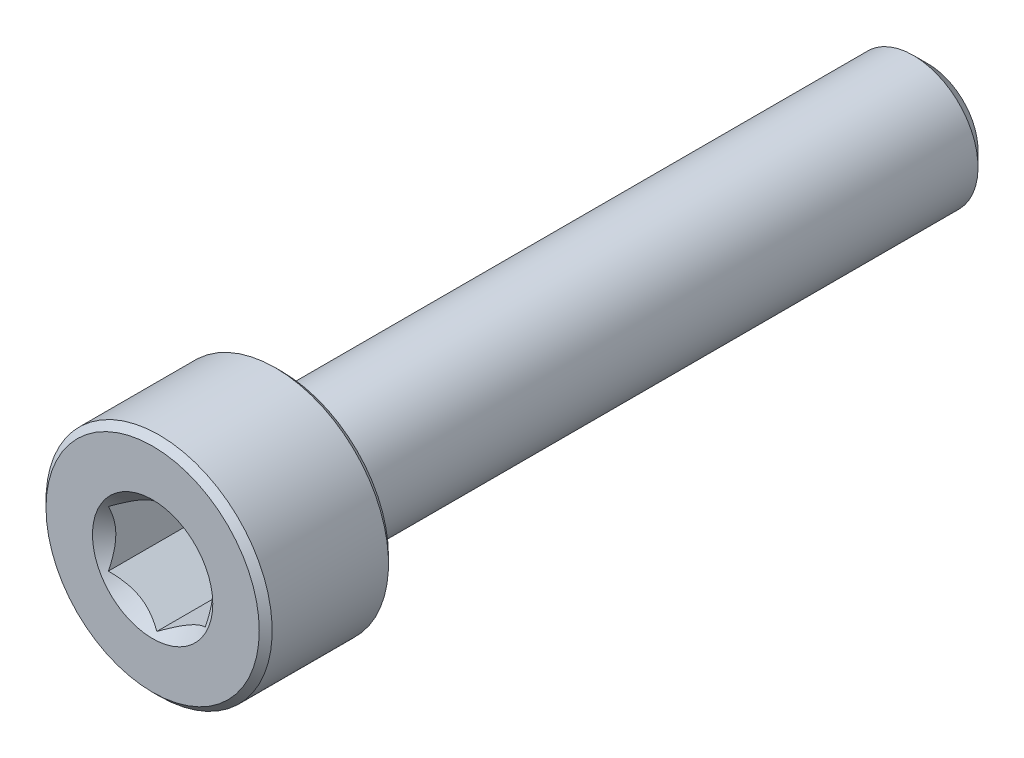
ISO-10303-21;
HEADER;
FILE_DESCRIPTION(('STEP AP214'),'2;1');
FILE_NAME('part.step','',(''),(''),'','','');
FILE_SCHEMA(('AUTOMOTIVE_DESIGN { 1 0 10303 214 1 1 1 1 }'));
ENDSEC;
DATA;
#1=APPLICATION_CONTEXT('core data for automotive mechanical design processes');
#2=APPLICATION_PROTOCOL_DEFINITION('international standard','automotive_design',2000,#1);
#3=PRODUCT_CONTEXT('',#1,'mechanical');
#4=PRODUCT('Part','Part','',(#3));
#5=PRODUCT_RELATED_PRODUCT_CATEGORY('part','',(#4));
#6=PRODUCT_DEFINITION_FORMATION('','',#4);
#7=PRODUCT_DEFINITION_CONTEXT('part definition',#1,'design');
#8=PRODUCT_DEFINITION('design','',#6,#7);
#9=PRODUCT_DEFINITION_SHAPE('','',#8);
#10=(LENGTH_UNIT() NAMED_UNIT(*) SI_UNIT(.MILLI.,.METRE.));
#11=(NAMED_UNIT(*) PLANE_ANGLE_UNIT() SI_UNIT($,.RADIAN.));
#12=(NAMED_UNIT(*) SI_UNIT($,.STERADIAN.) SOLID_ANGLE_UNIT());
#13=UNCERTAINTY_MEASURE_WITH_UNIT(LENGTH_MEASURE(1.E-05),#10,'distance_accuracy_value','');
#14=(GEOMETRIC_REPRESENTATION_CONTEXT(3) GLOBAL_UNCERTAINTY_ASSIGNED_CONTEXT((#13)) GLOBAL_UNIT_ASSIGNED_CONTEXT((#10,
#11,#12)) REPRESENTATION_CONTEXT('',''));
#15=CARTESIAN_POINT('',(0.,0.,0.));
#16=DIRECTION('',(0.,0.,1.));
#17=DIRECTION('',(1.,0.,0.));
#18=AXIS2_PLACEMENT_3D('',#15,#16,#17);
#19=CARTESIAN_POINT('',(0.,1.54533666301317,-12.));
#20=DIRECTION('',(0.,0.,-1.));
#21=DIRECTION('',(0.,1.,0.));
#22=AXIS2_PLACEMENT_3D('',#19,#20,#21);
#23=PLANE('',#22);
#24=CARTESIAN_POINT('',(0.,0.,-12.));
#25=DIRECTION('',(0.,0.,-1.));
#26=DIRECTION('',(0.,1.,0.));
#27=AXIS2_PLACEMENT_3D('',#24,#25,#26);
#28=CIRCLE('',#27,1.54533666301317);
#29=CARTESIAN_POINT('',(0.,1.54533666301317,-12.));
#30=VERTEX_POINT('',#29);
#31=EDGE_CURVE('E49',#30,#30,#28,.T.);
#32=ORIENTED_EDGE('',*,*,#31,.T.);
#33=EDGE_LOOP('',(#32));
#34=FACE_BOUND('',#33,.T.);
#35=ADVANCED_FACE('F36',(#34),#23,.T.);
#36=CARTESIAN_POINT('',(0.,0.,-12.));
#37=DIRECTION('',(0.,0.,1.));
#38=DIRECTION('',(0.,-1.,0.));
#39=AXIS2_PLACEMENT_3D('',#36,#37,#38);
#40=CONICAL_SURFACE('',#39,1.54533666301317,0.785398163397447);
#41=CARTESIAN_POINT('',(0.,0.,-11.5453366630132));
#42=DIRECTION('',(0.,0.,-1.));
#43=DIRECTION('',(0.,1.,0.));
#44=AXIS2_PLACEMENT_3D('',#41,#42,#43);
#45=CIRCLE('',#44,2.);
#46=CARTESIAN_POINT('',(0.,2.,-11.5453366630132));
#47=VERTEX_POINT('',#46);
#48=EDGE_CURVE('E152',#47,#47,#45,.T.);
#49=ORIENTED_EDGE('',*,*,#48,.T.);
#50=EDGE_LOOP('',(#49));
#51=FACE_BOUND('',#50,.T.);
#52=ORIENTED_EDGE('',*,*,#31,.F.);
#53=EDGE_LOOP('',(#52));
#54=FACE_BOUND('',#53,.T.);
#55=ADVANCED_FACE('F158',(#51,#54),#40,.T.);
#56=CARTESIAN_POINT('',(0.,0.,-12.));
#57=DIRECTION('',(0.,0.,-1.));
#58=DIRECTION('',(0.,1.,0.));
#59=AXIS2_PLACEMENT_3D('',#56,#57,#58);
#60=CYLINDRICAL_SURFACE('',#59,2.);
#61=CARTESIAN_POINT('',(0.,0.,7.8));
#62=DIRECTION('',(0.,0.,-1.));
#63=DIRECTION('',(0.,1.,0.));
#64=AXIS2_PLACEMENT_3D('',#61,#62,#63);
#65=CIRCLE('',#64,2.);
#66=CARTESIAN_POINT('',(0.,2.,7.8));
#67=VERTEX_POINT('',#66);
#68=EDGE_CURVE('E149',#67,#67,#65,.T.);
#69=ORIENTED_EDGE('',*,*,#68,.T.);
#70=EDGE_LOOP('',(#69));
#71=FACE_BOUND('',#70,.T.);
#72=ORIENTED_EDGE('',*,*,#48,.F.);
#73=EDGE_LOOP('',(#72));
#74=FACE_BOUND('',#73,.T.);
#75=ADVANCED_FACE('F160',(#71,#74),#60,.T.);
#76=CARTESIAN_POINT('',(0.,0.,7.8));
#77=DIRECTION('',(0.,0.,-1.));
#78=DIRECTION('',(0.,1.,0.));
#79=AXIS2_PLACEMENT_3D('',#76,#77,#78);
#80=TOROIDAL_SURFACE('',#79,2.2,0.2);
#81=CARTESIAN_POINT('',(0.,0.,8.));
#82=DIRECTION('',(0.,0.,-1.));
#83=DIRECTION('',(0.,1.,0.));
#84=AXIS2_PLACEMENT_3D('',#81,#82,#83);
#85=CIRCLE('',#84,2.2);
#86=CARTESIAN_POINT('',(0.,2.2,8.));
#87=VERTEX_POINT('',#86);
#88=EDGE_CURVE('E146',#87,#87,#85,.T.);
#89=ORIENTED_EDGE('',*,*,#88,.T.);
#90=EDGE_LOOP('',(#89));
#91=FACE_BOUND('',#90,.T.);
#92=ORIENTED_EDGE('',*,*,#68,.F.);
#93=EDGE_LOOP('',(#92));
#94=FACE_BOUND('',#93,.T.);
#95=ADVANCED_FACE('F166',(#91,#94),#80,.F.);
#96=CARTESIAN_POINT('',(0.,3.3,8.));
#97=DIRECTION('',(0.,0.,-1.));
#98=DIRECTION('',(0.,1.,0.));
#99=AXIS2_PLACEMENT_3D('',#96,#97,#98);
#100=PLANE('',#99);
#101=CARTESIAN_POINT('',(0.,0.,8.));
#102=DIRECTION('',(0.,0.,-1.));
#103=DIRECTION('',(0.,1.,0.));
#104=AXIS2_PLACEMENT_3D('',#101,#102,#103);
#105=CIRCLE('',#104,3.3);
#106=CARTESIAN_POINT('',(0.,3.3,8.));
#107=VERTEX_POINT('',#106);
#108=EDGE_CURVE('E143',#107,#107,#105,.T.);
#109=ORIENTED_EDGE('',*,*,#108,.T.);
#110=EDGE_LOOP('',(#109));
#111=FACE_BOUND('',#110,.T.);
#112=ORIENTED_EDGE('',*,*,#88,.F.);
#113=EDGE_LOOP('',(#112));
#114=FACE_BOUND('',#113,.T.);
#115=ADVANCED_FACE('F172',(#111,#114),#100,.T.);
#116=CARTESIAN_POINT('',(0.,0.,8.));
#117=DIRECTION('',(0.,0.,1.));
#118=DIRECTION('',(0.,-1.,0.));
#119=AXIS2_PLACEMENT_3D('',#116,#117,#118);
#120=CONICAL_SURFACE('',#119,3.3,0.785398163397443);
#121=CARTESIAN_POINT('',(0.,0.,8.2));
#122=DIRECTION('',(0.,0.,-1.));
#123=DIRECTION('',(0.,1.,0.));
#124=AXIS2_PLACEMENT_3D('',#121,#122,#123);
#125=CIRCLE('',#124,3.5);
#126=CARTESIAN_POINT('',(0.,3.5,8.2));
#127=VERTEX_POINT('',#126);
#128=EDGE_CURVE('E140',#127,#127,#125,.T.);
#129=ORIENTED_EDGE('',*,*,#128,.T.);
#130=EDGE_LOOP('',(#129));
#131=FACE_BOUND('',#130,.T.);
#132=ORIENTED_EDGE('',*,*,#108,.F.);
#133=EDGE_LOOP('',(#132));
#134=FACE_BOUND('',#133,.T.);
#135=ADVANCED_FACE('F176',(#131,#134),#120,.T.);
#136=CARTESIAN_POINT('',(0.,0.,-12.));
#137=DIRECTION('',(0.,0.,-1.));
#138=DIRECTION('',(0.,1.,0.));
#139=AXIS2_PLACEMENT_3D('',#136,#137,#138);
#140=CYLINDRICAL_SURFACE('',#139,3.5);
#141=CARTESIAN_POINT('',(0.,0.,11.8));
#142=DIRECTION('',(0.,0.,-1.));
#143=DIRECTION('',(0.,1.,0.));
#144=AXIS2_PLACEMENT_3D('',#141,#142,#143);
#145=CIRCLE('',#144,3.5);
#146=CARTESIAN_POINT('',(0.,3.5,11.8));
#147=VERTEX_POINT('',#146);
#148=EDGE_CURVE('E137',#147,#147,#145,.T.);
#149=ORIENTED_EDGE('',*,*,#148,.T.);
#150=EDGE_LOOP('',(#149));
#151=FACE_BOUND('',#150,.T.);
#152=ORIENTED_EDGE('',*,*,#128,.F.);
#153=EDGE_LOOP('',(#152));
#154=FACE_BOUND('',#153,.T.);
#155=ADVANCED_FACE('F180',(#151,#154),#140,.T.);
#156=CARTESIAN_POINT('',(0.,0.,11.8));
#157=DIRECTION('',(0.,0.,-1.));
#158=DIRECTION('',(0.,1.,0.));
#159=AXIS2_PLACEMENT_3D('',#156,#157,#158);
#160=CONICAL_SURFACE('',#159,3.5,0.785398163397452);
#161=CARTESIAN_POINT('',(0.,0.,12.));
#162=DIRECTION('',(0.,0.,-1.));
#163=DIRECTION('',(0.,1.,0.));
#164=AXIS2_PLACEMENT_3D('',#161,#162,#163);
#165=CIRCLE('',#164,3.3);
#166=CARTESIAN_POINT('',(0.,3.3,12.));
#167=VERTEX_POINT('',#166);
#168=EDGE_CURVE('E134',#167,#167,#165,.T.);
#169=ORIENTED_EDGE('',*,*,#168,.T.);
#170=EDGE_LOOP('',(#169));
#171=FACE_BOUND('',#170,.T.);
#172=ORIENTED_EDGE('',*,*,#148,.F.);
#173=EDGE_LOOP('',(#172));
#174=FACE_BOUND('',#173,.T.);
#175=ADVANCED_FACE('F184',(#171,#174),#160,.T.);
#176=CARTESIAN_POINT('',(0.,0.,12.));
#177=DIRECTION('',(0.,0.,1.));
#178=DIRECTION('',(0.,-1.,0.));
#179=AXIS2_PLACEMENT_3D('',#176,#177,#178);
#180=PLANE('',#179);
#181=CARTESIAN_POINT('',(0.,0.,12.));
#182=DIRECTION('',(0.,0.,1.));
#183=DIRECTION('',(1.,0.,0.));
#184=AXIS2_PLACEMENT_3D('',#181,#182,#183);
#185=CIRCLE('',#184,1.86195461813654);
#186=CARTESIAN_POINT('',(1.86195461813654,0.,12.));
#187=VERTEX_POINT('',#186);
#188=EDGE_CURVE('E108',#187,#187,#185,.T.);
#189=ORIENTED_EDGE('',*,*,#188,.F.);
#190=EDGE_LOOP('',(#189));
#191=FACE_BOUND('',#190,.T.);
#192=ORIENTED_EDGE('',*,*,#168,.F.);
#193=EDGE_LOOP('',(#192));
#194=FACE_BOUND('',#193,.T.);
#195=ADVANCED_FACE('F188',(#191,#194),#180,.T.);
#196=CARTESIAN_POINT('',(0.,0.,12.));
#197=DIRECTION('',(0.,0.,1.));
#198=DIRECTION('',(1.,0.,0.));
#199=AXIS2_PLACEMENT_3D('',#196,#197,#198);
#200=CONICAL_SURFACE('',#199,1.86195461813654,0.78539816339745);
#201=ORIENTED_EDGE('',*,*,#188,.T.);
#202=EDGE_LOOP('',(#201));
#203=FACE_BOUND('',#202,.T.);
#204=CARTESIAN_POINT('',(-0.000199999999999267,-1.73216627762272,11.8702116710324));
#205=CARTESIAN_POINT('',(0.0513677907370761,-1.70239359975915,11.8404616654997));
#206=CARTESIAN_POINT('',(0.103797917665201,-1.67212305186355,11.8124586733426));
#207=CARTESIAN_POINT('',(0.210709034055597,-1.61039789003619,11.7611854198725));
#208=CARTESIAN_POINT('',(0.265200195814661,-1.57893740312614,11.7379436944767));
#209=CARTESIAN_POINT('',(0.375079081357248,-1.51549879897987,11.6981299184246));
#210=CARTESIAN_POINT('',(0.4304388090952,-1.4835368452681,11.6814577751032));
#211=CARTESIAN_POINT('',(0.542377257477151,-1.41890915196211,11.6557706462504));
#212=CARTESIAN_POINT('',(0.598952556553009,-1.38624538781118,11.6467364799112));
#213=CARTESIAN_POINT('',(0.696455389516441,-1.32995210095299,11.6385852706592));
#214=CARTESIAN_POINT('',(0.737256908280466,-1.30639533311124,11.6373784424216));
#215=CARTESIAN_POINT('',(0.818787969615858,-1.25932335290193,11.6394102465946));
#216=CARTESIAN_POINT('',(0.85951749431463,-1.23580815085313,11.6426498601806));
#217=CARTESIAN_POINT('',(0.940584402163416,-1.18900414978427,11.6533881754143));
#218=CARTESIAN_POINT('',(0.980921384598288,-1.1657155821172,11.6608908424511));
#219=CARTESIAN_POINT('',(1.06091833691403,-1.11952932016335,11.6797478013606));
#220=CARTESIAN_POINT('',(1.10057800851621,-1.09663179808786,11.6911037464509));
#221=CARTESIAN_POINT('',(1.20216313477448,-1.03798159809698,11.724817837025));
#222=CARTESIAN_POINT('',(1.26345855370969,-1.00259267147465,11.7497180385257));
#223=CARTESIAN_POINT('',(1.35358562846331,-0.950557780604375,11.7917528427039));
#224=CARTESIAN_POINT('',(1.38328513990772,-0.933410759677148,11.8065213429914));
#225=CARTESIAN_POINT('',(1.44213790138375,-0.899432101996407,11.8374067553725));
#226=CARTESIAN_POINT('',(1.47129140422064,-0.88260031928571,11.853523023554));
#227=CARTESIAN_POINT('',(1.5002,-0.865909933730601,11.8702116710324));
#228=B_SPLINE_CURVE_WITH_KNOTS('',3,(#204,#205,#206,#207,#208,#209,#210,#211,#212,#213,#214,
#215,#216,#217,#218,#219,#220,#221,#222,#223,#224,#225,#226,#227),.UNSPECIFIED.,.F.,.F.,(4,2,2,
2,2,2,2,2,2,2,2,4),(0.,0.199829143693304,0.400822987382388,0.59862372053818,0.795926240188888,
0.93711306795988,1.07833105577193,1.21968061668222,1.36109089931054,1.58570969637565,
1.69770705470963,1.80965120737194),.UNSPECIFIED.);
#229=CARTESIAN_POINT('',(0.,-1.73205080756888,11.8700961894323));
#230=VERTEX_POINT('',#229);
#231=CARTESIAN_POINT('',(1.5,-0.866025403784439,11.8700961894323));
#232=VERTEX_POINT('',#231);
#233=EDGE_CURVE('E12',#230,#232,#228,.T.);
#234=ORIENTED_EDGE('',*,*,#233,.F.);
#235=CARTESIAN_POINT('',(-1.5002,-0.865909933730601,11.8702116710324));
#236=CARTESIAN_POINT('',(-1.44863220926292,-0.895682611594166,11.8404616654997));
#237=CARTESIAN_POINT('',(-1.3962020823348,-0.925953159489765,11.8124586733426));
#238=CARTESIAN_POINT('',(-1.2892909659444,-0.987678321317124,11.7611854198725));
#239=CARTESIAN_POINT('',(-1.23479980418534,-1.01913880822717,11.7379436944767));
#240=CARTESIAN_POINT('',(-1.12492091864275,-1.08257741237344,11.6981299184246));
#241=CARTESIAN_POINT('',(-1.0695611909048,-1.11453936608521,11.6814577751032));
#242=CARTESIAN_POINT('',(-0.95762274252285,-1.1791670593912,11.6557706462504));
#243=CARTESIAN_POINT('',(-0.901047443446992,-1.21183082354213,11.6467364799112));
#244=CARTESIAN_POINT('',(-0.80354461048356,-1.26812411040032,11.6385852706592));
#245=CARTESIAN_POINT('',(-0.762743091719534,-1.29168087824208,11.6373784424216));
#246=CARTESIAN_POINT('',(-0.681212030384142,-1.33875285845138,11.6394102465946));
#247=CARTESIAN_POINT('',(-0.640482505685371,-1.36226806050018,11.6426498601806));
#248=CARTESIAN_POINT('',(-0.559415597836584,-1.40907206156905,11.6533881754143));
#249=CARTESIAN_POINT('',(-0.519078615401712,-1.43236062923612,11.6608908424511));
#250=CARTESIAN_POINT('',(-0.439081663085969,-1.47854689118996,11.6797478013606));
#251=CARTESIAN_POINT('',(-0.399421991483792,-1.50144441326545,11.6911037464509));
#252=CARTESIAN_POINT('',(-0.297836865225515,-1.56009461325633,11.724817837025));
#253=CARTESIAN_POINT('',(-0.236541446290311,-1.59548353987866,11.7497180385257));
#254=CARTESIAN_POINT('',(-0.146414371536686,-1.64751843074894,11.7917528427039));
#255=CARTESIAN_POINT('',(-0.116714860092282,-1.66466545167617,11.8065213429914));
#256=CARTESIAN_POINT('',(-0.0578620986162489,-1.69864410935691,11.8374067553725));
#257=CARTESIAN_POINT('',(-0.0287085957793626,-1.71547589206761,11.853523023554));
#258=CARTESIAN_POINT('',(0.000200000000000409,-1.73216627762272,11.8702116710324));
#259=B_SPLINE_CURVE_WITH_KNOTS('',3,(#235,#236,#237,#238,#239,#240,#241,#242,#243,#244,#245,
#246,#247,#248,#249,#250,#251,#252,#253,#254,#255,#256,#257,#258),.UNSPECIFIED.,.F.,.F.,(4,2,2,
2,2,2,2,2,2,2,2,4),(0.,0.199829143693304,0.400822987382388,0.59862372053818,0.795926240188888,
0.93711306795988,1.07833105577193,1.21968061668222,1.36109089931054,1.58570969637565,
1.69770705470964,1.80965120737194),.UNSPECIFIED.);
#260=CARTESIAN_POINT('',(-1.5,-0.866025403784439,11.8700961894323));
#261=VERTEX_POINT('',#260);
#262=EDGE_CURVE('E94',#261,#230,#259,.T.);
#263=ORIENTED_EDGE('',*,*,#262,.F.);
#264=CARTESIAN_POINT('',(-1.5,-1.81798631684901,12.4949658829093));
#265=CARTESIAN_POINT('',(-1.5,-1.77410479833239,12.461123354197));
#266=CARTESIAN_POINT('',(-1.5,-1.72998897047494,12.427585617689));
#267=CARTESIAN_POINT('',(-1.5,-1.64119029432319,12.3612481734927));
#268=CARTESIAN_POINT('',(-1.5,-1.59650731534755,12.328448640911));
#269=CARTESIAN_POINT('',(-1.5,-1.460806940489,12.2308819314804));
#270=CARTESIAN_POINT('',(-1.5,-1.36880251235632,12.1674654206559));
#271=CARTESIAN_POINT('',(-1.5,-1.17526237686872,12.0421023717216));
#272=CARTESIAN_POINT('',(-1.5,-1.07349393006072,11.9805114153672));
#273=CARTESIAN_POINT('',(-1.5,-0.864764842560626,11.8672522059965));
#274=CARTESIAN_POINT('',(-1.5,-0.757823334449948,11.8155504395058));
#275=CARTESIAN_POINT('',(-1.5,-0.598146069886858,11.7522731736164));
#276=CARTESIAN_POINT('',(-1.5,-0.547969945491557,11.7342740839912));
#277=CARTESIAN_POINT('',(-1.5,-0.446326869364775,11.7022954652208));
#278=CARTESIAN_POINT('',(-1.5,-0.394859836419925,11.6883161896624));
#279=CARTESIAN_POINT('',(-1.5,-0.291848397493325,11.6653656903726));
#280=CARTESIAN_POINT('',(-1.5,-0.240324749628771,11.6563028154328));
#281=CARTESIAN_POINT('',(-1.5,-0.13662544851591,11.6433771152152));
#282=CARTESIAN_POINT('',(-1.5,-0.0844499362377799,11.6395131846234));
#283=CARTESIAN_POINT('',(-1.5,0.0176806967011133,11.6373196125689));
#284=CARTESIAN_POINT('',(-1.5,0.0676307045116619,11.6387500692366));
#285=CARTESIAN_POINT('',(-1.5,0.167145477637761,11.6465133142386));
#286=CARTESIAN_POINT('',(-1.5,0.216710207908514,11.6528465433779));
#287=CARTESIAN_POINT('',(-1.5,0.315937150651982,11.6701627170715));
#288=CARTESIAN_POINT('',(-1.5,0.365584733694538,11.6812281518103));
#289=CARTESIAN_POINT('',(-1.5,0.46378160619877,11.7073934991991));
#290=CARTESIAN_POINT('',(-1.5,0.512330953840259,11.7224931975855));
#291=CARTESIAN_POINT('',(-1.5,0.66131302328769,11.7746138556917));
#292=CARTESIAN_POINT('',(-1.5,0.759720789706277,11.8174049630424));
#293=CARTESIAN_POINT('',(-1.5,0.95194266902277,11.9126388372101));
#294=CARTESIAN_POINT('',(-1.5,1.04573912191844,11.9651155264859));
#295=CARTESIAN_POINT('',(-1.5,1.22504153577549,12.0734783373155));
#296=CARTESIAN_POINT('',(-1.5,1.3107282773288,12.1290691055441));
#297=CARTESIAN_POINT('',(-1.5,1.43696960041027,12.2150504562164));
#298=CARTESIAN_POINT('',(-1.5,1.47850725450332,12.2440226829709));
#299=CARTESIAN_POINT('',(-1.5,1.56101250374723,12.3027448839378));
#300=CARTESIAN_POINT('',(-1.5,1.60198025290925,12.3324946415183));
#301=CARTESIAN_POINT('',(-1.5,1.64271029717086,12.362567155286));
#302=B_SPLINE_CURVE_WITH_KNOTS('',3,(#264,#265,#266,#267,#268,#269,#270,#271,#272,#273,#274,
#275,#276,#277,#278,#279,#280,#281,#282,#283,#284,#285,#286,#287,#288,#289,#290,#291,#292,#293,
#294,#295,#296,#297,#298,#299,#300,#301),.UNSPECIFIED.,.F.,.F.,(4,2,2,2,2,2,2,2,2,2,2,2,2,2,2,2,
2,2,4),(0.,0.166243250325254,0.332525527595493,0.667617582874063,1.02421660314856,
1.37958485991001,1.53937185590112,1.69916892971772,1.85587466130012,2.01254707142443,
2.16220898927398,2.31188436469118,2.46428258498153,2.61667271286894,2.93766301623296,
3.25979964661299,3.56606529199602,3.71798989158864,3.86987260467919),.UNSPECIFIED.);
#303=CARTESIAN_POINT('',(-1.5,0.866025403784438,11.8700961894323));
#304=VERTEX_POINT('',#303);
#305=EDGE_CURVE('E107',#304,#261,#302,.F.);
#306=ORIENTED_EDGE('',*,*,#305,.F.);
#307=CARTESIAN_POINT('',(0.000199999999999471,1.73216627762272,11.8702116710324));
#308=CARTESIAN_POINT('',(-0.0513677907370762,1.70239359975915,11.8404616654997));
#309=CARTESIAN_POINT('',(-0.103797917665201,1.67212305186355,11.8124586733426));
#310=CARTESIAN_POINT('',(-0.210709034055597,1.61039789003619,11.7611854198725));
#311=CARTESIAN_POINT('',(-0.265200195814661,1.57893740312614,11.7379436944767));
#312=CARTESIAN_POINT('',(-0.375079081357249,1.51549879897987,11.6981299184246));
#313=CARTESIAN_POINT('',(-0.4304388090952,1.4835368452681,11.6814577751032));
#314=CARTESIAN_POINT('',(-0.54237725747715,1.41890915196211,11.6557706462504));
#315=CARTESIAN_POINT('',(-0.598952556553008,1.38624538781118,11.6467364799112));
#316=CARTESIAN_POINT('',(-0.69645538951644,1.329952100953,11.6385852706592));
#317=CARTESIAN_POINT('',(-0.737256908280466,1.30639533311124,11.6373784424216));
#318=CARTESIAN_POINT('',(-0.818787969615858,1.25932335290194,11.6394102465946));
#319=CARTESIAN_POINT('',(-0.859517494314629,1.23580815085313,11.6426498601806));
#320=CARTESIAN_POINT('',(-0.940584402163415,1.18900414978427,11.6533881754143));
#321=CARTESIAN_POINT('',(-0.980921384598287,1.1657155821172,11.6608908424511));
#322=CARTESIAN_POINT('',(-1.06091833691403,1.11952932016335,11.6797478013606));
#323=CARTESIAN_POINT('',(-1.10057800851621,1.09663179808786,11.6911037464509));
#324=CARTESIAN_POINT('',(-1.20216313477448,1.03798159809698,11.724817837025));
#325=CARTESIAN_POINT('',(-1.26345855370969,1.00259267147465,11.7497180385257));
#326=CARTESIAN_POINT('',(-1.35358562846331,0.950557780604375,11.7917528427039));
#327=CARTESIAN_POINT('',(-1.38328513990772,0.933410759677147,11.8065213429914));
#328=CARTESIAN_POINT('',(-1.44213790138375,0.899432101996407,11.8374067553725));
#329=CARTESIAN_POINT('',(-1.47129140422064,0.88260031928571,11.853523023554));
#330=CARTESIAN_POINT('',(-1.5002,0.8659099337306,11.8702116710324));
#331=B_SPLINE_CURVE_WITH_KNOTS('',3,(#307,#308,#309,#310,#311,#312,#313,#314,#315,#316,#317,
#318,#319,#320,#321,#322,#323,#324,#325,#326,#327,#328,#329,#330),.UNSPECIFIED.,.F.,.F.,(4,2,2,
2,2,2,2,2,2,2,2,4),(0.,0.199829143693305,0.400822987382388,0.59862372053818,0.795926240188888,
0.93711306795988,1.07833105577193,1.21968061668222,1.36109089931054,1.58570969637565,
1.69770705470964,1.80965120737194),.UNSPECIFIED.);
#332=CARTESIAN_POINT('',(0.,1.73205080756888,11.8700961894323));
#333=VERTEX_POINT('',#332);
#334=EDGE_CURVE('E238',#333,#304,#331,.T.);
#335=ORIENTED_EDGE('',*,*,#334,.F.);
#336=CARTESIAN_POINT('',(1.5002,0.865909933730601,11.8702116710324));
#337=CARTESIAN_POINT('',(1.44863220926292,0.895682611594166,11.8404616654997));
#338=CARTESIAN_POINT('',(1.3962020823348,0.925953159489765,11.8124586733426));
#339=CARTESIAN_POINT('',(1.2892909659444,0.987678321317124,11.7611854198725));
#340=CARTESIAN_POINT('',(1.23479980418534,1.01913880822718,11.7379436944767));
#341=CARTESIAN_POINT('',(1.12492091864275,1.08257741237344,11.6981299184246));
#342=CARTESIAN_POINT('',(1.0695611909048,1.11453936608521,11.6814577751032));
#343=CARTESIAN_POINT('',(0.957622742522849,1.1791670593912,11.6557706462504));
#344=CARTESIAN_POINT('',(0.901047443446992,1.21183082354213,11.6467364799112));
#345=CARTESIAN_POINT('',(0.803544610483559,1.26812411040032,11.6385852706592));
#346=CARTESIAN_POINT('',(0.762743091719534,1.29168087824208,11.6373784424216));
#347=CARTESIAN_POINT('',(0.681212030384142,1.33875285845138,11.6394102465946));
#348=CARTESIAN_POINT('',(0.64048250568537,1.36226806050018,11.6426498601806));
#349=CARTESIAN_POINT('',(0.559415597836584,1.40907206156905,11.6533881754143));
#350=CARTESIAN_POINT('',(0.519078615401712,1.43236062923612,11.6608908424511));
#351=CARTESIAN_POINT('',(0.439081663085969,1.47854689118996,11.6797478013606));
#352=CARTESIAN_POINT('',(0.399421991483792,1.50144441326545,11.6911037464509));
#353=CARTESIAN_POINT('',(0.297836865225515,1.56009461325633,11.724817837025));
#354=CARTESIAN_POINT('',(0.236541446290311,1.59548353987866,11.7497180385257));
#355=CARTESIAN_POINT('',(0.146414371536687,1.64751843074894,11.7917528427039));
#356=CARTESIAN_POINT('',(0.116714860092282,1.66466545167617,11.8065213429914));
#357=CARTESIAN_POINT('',(0.0578620986162492,1.69864410935691,11.8374067553725));
#358=CARTESIAN_POINT('',(0.0287085957793629,1.71547589206761,11.853523023554));
#359=CARTESIAN_POINT('',(-0.000200000000000123,1.73216627762272,11.8702116710324));
#360=B_SPLINE_CURVE_WITH_KNOTS('',3,(#336,#337,#338,#339,#340,#341,#342,#343,#344,#345,#346,
#347,#348,#349,#350,#351,#352,#353,#354,#355,#356,#357,#358,#359),.UNSPECIFIED.,.F.,.F.,(4,2,2,
2,2,2,2,2,2,2,2,4),(0.,0.199829143693305,0.400822987382389,0.598623720538181,0.795926240188889,
0.937113067959881,1.07833105577193,1.21968061668222,1.36109089931054,1.58570969637565,
1.69770705470964,1.80965120737194),.UNSPECIFIED.);
#361=CARTESIAN_POINT('',(1.5,0.866025403784439,11.8700961894323));
#362=VERTEX_POINT('',#361);
#363=EDGE_CURVE('E211',#362,#333,#360,.T.);
#364=ORIENTED_EDGE('',*,*,#363,.F.);
#365=CARTESIAN_POINT('',(1.5,-1.81798631684901,12.4949658829093));
#366=CARTESIAN_POINT('',(1.5,-1.77410479833238,12.461123354197));
#367=CARTESIAN_POINT('',(1.5,-1.72998897047494,12.427585617689));
#368=CARTESIAN_POINT('',(1.5,-1.64119029432319,12.3612481734927));
#369=CARTESIAN_POINT('',(1.5,-1.59650731534755,12.328448640911));
#370=CARTESIAN_POINT('',(1.5,-1.460806940489,12.2308819314804));
#371=CARTESIAN_POINT('',(1.5,-1.36880251235632,12.1674654206559));
#372=CARTESIAN_POINT('',(1.5,-1.17526237686872,12.0421023717216));
#373=CARTESIAN_POINT('',(1.5,-1.07349393006072,11.9805114153672));
#374=CARTESIAN_POINT('',(1.5,-0.864764842560626,11.8672522059965));
#375=CARTESIAN_POINT('',(1.5,-0.757823334449948,11.8155504395058));
#376=CARTESIAN_POINT('',(1.5,-0.598146069886857,11.7522731736164));
#377=CARTESIAN_POINT('',(1.5,-0.547969945491556,11.7342740839912));
#378=CARTESIAN_POINT('',(1.5,-0.446326869364773,11.7022954652208));
#379=CARTESIAN_POINT('',(1.5,-0.394859836419924,11.6883161896624));
#380=CARTESIAN_POINT('',(1.5,-0.291848397493324,11.6653656903726));
#381=CARTESIAN_POINT('',(1.5,-0.24032474962877,11.6563028154328));
#382=CARTESIAN_POINT('',(1.5,-0.13662544851591,11.6433771152152));
#383=CARTESIAN_POINT('',(1.5,-0.0844499362377794,11.6395131846234));
#384=CARTESIAN_POINT('',(1.5,0.0176806967011135,11.6373196125689));
#385=CARTESIAN_POINT('',(1.5,0.067630704511662,11.6387500692366));
#386=CARTESIAN_POINT('',(1.5,0.167145477637761,11.6465133142386));
#387=CARTESIAN_POINT('',(1.5,0.216710207908514,11.6528465433779));
#388=CARTESIAN_POINT('',(1.5,0.315937150651983,11.6701627170715));
#389=CARTESIAN_POINT('',(1.5,0.365584733694539,11.6812281518103));
#390=CARTESIAN_POINT('',(1.5,0.46378160619877,11.7073934991991));
#391=CARTESIAN_POINT('',(1.5,0.51233095384026,11.7224931975855));
#392=CARTESIAN_POINT('',(1.5,0.661313023287691,11.7746138556917));
#393=CARTESIAN_POINT('',(1.5,0.759720789706278,11.8174049630424));
#394=CARTESIAN_POINT('',(1.5,0.951942669022772,11.9126388372101));
#395=CARTESIAN_POINT('',(1.5,1.04573912191844,11.965115526486));
#396=CARTESIAN_POINT('',(1.5,1.22504153577549,12.0734783373155));
#397=CARTESIAN_POINT('',(1.5,1.3107282773288,12.1290691055441));
#398=CARTESIAN_POINT('',(1.5,1.43696960041028,12.2150504562164));
#399=CARTESIAN_POINT('',(1.5,1.47850725450332,12.2440226829709));
#400=CARTESIAN_POINT('',(1.5,1.56101250374723,12.3027448839378));
#401=CARTESIAN_POINT('',(1.5,1.60198025290925,12.3324946415183));
#402=CARTESIAN_POINT('',(1.5,1.64271029717086,12.362567155286));
#403=B_SPLINE_CURVE_WITH_KNOTS('',3,(#365,#366,#367,#368,#369,#370,#371,#372,#373,#374,#375,
#376,#377,#378,#379,#380,#381,#382,#383,#384,#385,#386,#387,#388,#389,#390,#391,#392,#393,#394,
#395,#396,#397,#398,#399,#400,#401,#402),.UNSPECIFIED.,.F.,.F.,(4,2,2,2,2,2,2,2,2,2,2,2,2,2,2,2,
2,2,4),(0.,0.166243250325254,0.332525527595493,0.667617582874063,1.02421660314856,
1.37958485991001,1.53937185590113,1.69916892971772,1.85587466130012,2.01254707142443,
2.16220898927398,2.31188436469118,2.46428258498153,2.61667271286894,2.93766301623296,
3.25979964661299,3.56606529199603,3.71798989158865,3.86987260467919),.UNSPECIFIED.);
#404=EDGE_CURVE('E56',#232,#362,#403,.T.);
#405=ORIENTED_EDGE('',*,*,#404,.F.);
#406=EDGE_LOOP('',(#234,#263,#306,#335,#364,#405));
#407=FACE_BOUND('',#406,.T.);
#408=ADVANCED_FACE('F93',(#203,#407),#200,.F.);
#409=CARTESIAN_POINT('',(0.,3.3,9.));
#410=DIRECTION('',(0.,0.,-1.));
#411=DIRECTION('',(0.,1.,0.));
#412=AXIS2_PLACEMENT_3D('',#409,#410,#411);
#413=PLANE('',#412);
#414=DIRECTION('',(0.866025403784438,0.5,0.));
#415=VECTOR('',#414,1.);
#416=CARTESIAN_POINT('',(0.,-1.73205080756888,9.));
#417=LINE('',#416,#415);
#418=CARTESIAN_POINT('',(0.,-1.73205080756888,9.));
#419=VERTEX_POINT('',#418);
#420=CARTESIAN_POINT('',(1.5,-0.866025403784439,9.));
#421=VERTEX_POINT('',#420);
#422=EDGE_CURVE('E111',#419,#421,#417,.T.);
#423=ORIENTED_EDGE('',*,*,#422,.T.);
#424=DIRECTION('',(0.,1.,0.));
#425=VECTOR('',#424,1.);
#426=CARTESIAN_POINT('',(1.5,-0.866025403784439,9.));
#427=LINE('',#426,#425);
#428=CARTESIAN_POINT('',(1.5,0.866025403784439,9.));
#429=VERTEX_POINT('',#428);
#430=EDGE_CURVE('E63',#421,#429,#427,.T.);
#431=ORIENTED_EDGE('',*,*,#430,.T.);
#432=DIRECTION('',(-0.866025403784439,0.5,0.));
#433=VECTOR('',#432,1.);
#434=CARTESIAN_POINT('',(1.5,0.866025403784439,9.));
#435=LINE('',#434,#433);
#436=CARTESIAN_POINT('',(0.,1.73205080756888,9.));
#437=VERTEX_POINT('',#436);
#438=EDGE_CURVE('E119',#429,#437,#435,.T.);
#439=ORIENTED_EDGE('',*,*,#438,.T.);
#440=DIRECTION('',(-0.866025403784439,-0.5,0.));
#441=VECTOR('',#440,1.);
#442=CARTESIAN_POINT('',(0.,1.73205080756888,9.));
#443=LINE('',#442,#441);
#444=CARTESIAN_POINT('',(-1.5,0.866025403784439,9.));
#445=VERTEX_POINT('',#444);
#446=EDGE_CURVE('E126',#437,#445,#443,.T.);
#447=ORIENTED_EDGE('',*,*,#446,.T.);
#448=DIRECTION('',(0.,-1.,0.));
#449=VECTOR('',#448,1.);
#450=CARTESIAN_POINT('',(-1.5,0.866025403784438,9.));
#451=LINE('',#450,#449);
#452=CARTESIAN_POINT('',(-1.5,-0.866025403784439,9.));
#453=VERTEX_POINT('',#452);
#454=EDGE_CURVE('E122',#445,#453,#451,.T.);
#455=ORIENTED_EDGE('',*,*,#454,.T.);
#456=DIRECTION('',(0.866025403784439,-0.5,0.));
#457=VECTOR('',#456,1.);
#458=CARTESIAN_POINT('',(-1.5,-0.866025403784439,9.));
#459=LINE('',#458,#457);
#460=EDGE_CURVE('E112',#453,#419,#459,.T.);
#461=ORIENTED_EDGE('',*,*,#460,.T.);
#462=EDGE_LOOP('',(#423,#431,#439,#447,#455,#461));
#463=FACE_BOUND('',#462,.T.);
#464=ADVANCED_FACE('F193',(#463),#413,.F.);
#465=CARTESIAN_POINT('',(0.,-1.73205080756888,3.41742430504416));
#466=DIRECTION('',(0.5,-0.866025403784438,0.));
#467=DIRECTION('',(0.866025403784438,0.5,0.));
#468=AXIS2_PLACEMENT_3D('',#465,#466,#467);
#469=PLANE('',#468);
#470=DIRECTION('',(0.,0.,1.));
#471=VECTOR('',#470,1.);
#472=CARTESIAN_POINT('',(0.,-1.73205080756888,3.41742430504416));
#473=LINE('',#472,#471);
#474=EDGE_CURVE('E103',#419,#230,#473,.T.);
#475=ORIENTED_EDGE('',*,*,#474,.T.);
#476=ORIENTED_EDGE('',*,*,#233,.T.);
#477=DIRECTION('',(0.,0.,1.));
#478=VECTOR('',#477,1.);
#479=CARTESIAN_POINT('',(1.5,-0.866025403784439,3.41742430504416));
#480=LINE('',#479,#478);
#481=EDGE_CURVE('E114',#421,#232,#480,.T.);
#482=ORIENTED_EDGE('',*,*,#481,.F.);
#483=ORIENTED_EDGE('',*,*,#422,.F.);
#484=EDGE_LOOP('',(#475,#476,#482,#483));
#485=FACE_BOUND('',#484,.T.);
#486=ADVANCED_FACE('F110',(#485),#469,.F.);
#487=CARTESIAN_POINT('',(-1.5,-0.866025403784439,3.41742430504416));
#488=DIRECTION('',(-0.5,-0.866025403784439,0.));
#489=DIRECTION('',(0.866025403784439,-0.5,0.));
#490=AXIS2_PLACEMENT_3D('',#487,#488,#489);
#491=PLANE('',#490);
#492=DIRECTION('',(0.,0.,1.));
#493=VECTOR('',#492,1.);
#494=CARTESIAN_POINT('',(-1.5,-0.866025403784439,3.41742430504416));
#495=LINE('',#494,#493);
#496=EDGE_CURVE('E106',#453,#261,#495,.T.);
#497=ORIENTED_EDGE('',*,*,#496,.T.);
#498=ORIENTED_EDGE('',*,*,#262,.T.);
#499=ORIENTED_EDGE('',*,*,#474,.F.);
#500=ORIENTED_EDGE('',*,*,#460,.F.);
#501=EDGE_LOOP('',(#497,#498,#499,#500));
#502=FACE_BOUND('',#501,.T.);
#503=ADVANCED_FACE('F102',(#502),#491,.F.);
#504=CARTESIAN_POINT('',(-1.5,0.866025403784438,3.41742430504416));
#505=DIRECTION('',(-1.,0.,0.));
#506=DIRECTION('',(0.,0.,1.));
#507=AXIS2_PLACEMENT_3D('',#504,#505,#506);
#508=PLANE('',#507);
#509=DIRECTION('',(0.,0.,1.));
#510=VECTOR('',#509,1.);
#511=CARTESIAN_POINT('',(-1.5,0.866025403784438,3.41742430504416));
#512=LINE('',#511,#510);
#513=EDGE_CURVE('E123',#445,#304,#512,.T.);
#514=ORIENTED_EDGE('',*,*,#513,.T.);
#515=ORIENTED_EDGE('',*,*,#305,.T.);
#516=ORIENTED_EDGE('',*,*,#496,.F.);
#517=ORIENTED_EDGE('',*,*,#454,.F.);
#518=EDGE_LOOP('',(#514,#515,#516,#517));
#519=FACE_BOUND('',#518,.T.);
#520=ADVANCED_FACE('F247',(#519),#508,.F.);
#521=CARTESIAN_POINT('',(0.,1.73205080756888,3.41742430504416));
#522=DIRECTION('',(-0.5,0.866025403784438,0.));
#523=DIRECTION('',(-0.866025403784439,-0.5,0.));
#524=AXIS2_PLACEMENT_3D('',#521,#522,#523);
#525=PLANE('',#524);
#526=DIRECTION('',(0.,0.,1.));
#527=VECTOR('',#526,1.);
#528=CARTESIAN_POINT('',(0.,1.73205080756888,3.41742430504416));
#529=LINE('',#528,#527);
#530=EDGE_CURVE('E127',#437,#333,#529,.T.);
#531=ORIENTED_EDGE('',*,*,#530,.T.);
#532=ORIENTED_EDGE('',*,*,#334,.T.);
#533=ORIENTED_EDGE('',*,*,#513,.F.);
#534=ORIENTED_EDGE('',*,*,#446,.F.);
#535=EDGE_LOOP('',(#531,#532,#533,#534));
#536=FACE_BOUND('',#535,.T.);
#537=ADVANCED_FACE('F244',(#536),#525,.F.);
#538=CARTESIAN_POINT('',(1.5,0.866025403784439,3.41742430504416));
#539=DIRECTION('',(0.5,0.866025403784439,0.));
#540=DIRECTION('',(-0.866025403784439,0.5,0.));
#541=AXIS2_PLACEMENT_3D('',#538,#539,#540);
#542=PLANE('',#541);
#543=DIRECTION('',(0.,0.,1.));
#544=VECTOR('',#543,1.);
#545=CARTESIAN_POINT('',(1.5,0.866025403784439,3.41742430504416));
#546=LINE('',#545,#544);
#547=EDGE_CURVE('E130',#429,#362,#546,.T.);
#548=ORIENTED_EDGE('',*,*,#547,.T.);
#549=ORIENTED_EDGE('',*,*,#363,.T.);
#550=ORIENTED_EDGE('',*,*,#530,.F.);
#551=ORIENTED_EDGE('',*,*,#438,.F.);
#552=EDGE_LOOP('',(#548,#549,#550,#551));
#553=FACE_BOUND('',#552,.T.);
#554=ADVANCED_FACE('F201',(#553),#542,.F.);
#555=CARTESIAN_POINT('',(1.5,-0.866025403784439,3.41742430504416));
#556=DIRECTION('',(1.,0.,0.));
#557=DIRECTION('',(0.,0.,-1.));
#558=AXIS2_PLACEMENT_3D('',#555,#556,#557);
#559=PLANE('',#558);
#560=ORIENTED_EDGE('',*,*,#481,.T.);
#561=ORIENTED_EDGE('',*,*,#404,.T.);
#562=ORIENTED_EDGE('',*,*,#547,.F.);
#563=ORIENTED_EDGE('',*,*,#430,.F.);
#564=EDGE_LOOP('',(#560,#561,#562,#563));
#565=FACE_BOUND('',#564,.T.);
#566=ADVANCED_FACE('F197',(#565),#559,.F.);
#567=CLOSED_SHELL('',(#35,#55,#75,#95,#115,#135,#155,#175,#195,#408,#464,#486,#503,#520,#537,
#554,#566));
#568=MANIFOLD_SOLID_BREP('B2',#567);
#569=ADVANCED_BREP_SHAPE_REPRESENTATION('',(#18,#568),#14);
#570=SHAPE_DEFINITION_REPRESENTATION(#9,#569);
ENDSEC;
END-ISO-10303-21;
